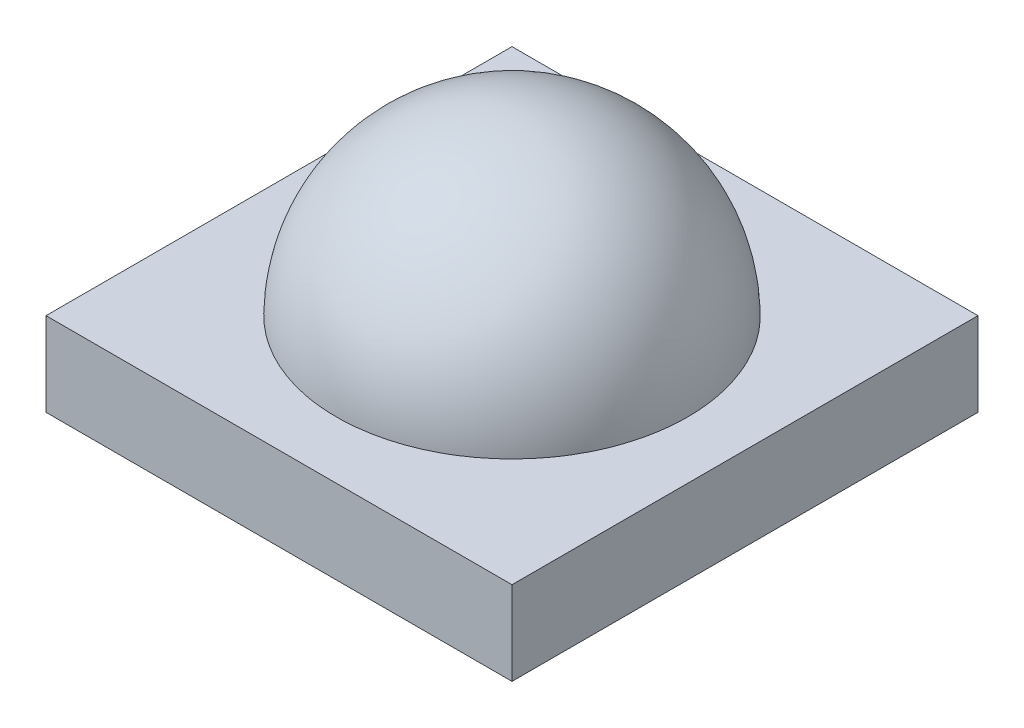
ISO-10303-21;
HEADER;
FILE_DESCRIPTION(('STEP AP214'),'2;1');
FILE_NAME('part.step','',(''),(''),'','','');
FILE_SCHEMA(('AUTOMOTIVE_DESIGN { 1 0 10303 214 1 1 1 1 }'));
ENDSEC;
DATA;
#1=APPLICATION_CONTEXT('core data for automotive mechanical design processes');
#2=APPLICATION_PROTOCOL_DEFINITION('international standard','automotive_design',2000,#1);
#3=PRODUCT_CONTEXT('',#1,'mechanical');
#4=PRODUCT('Part','Part','',(#3));
#5=PRODUCT_RELATED_PRODUCT_CATEGORY('part','',(#4));
#6=PRODUCT_DEFINITION_FORMATION('','',#4);
#7=PRODUCT_DEFINITION_CONTEXT('part definition',#1,'design');
#8=PRODUCT_DEFINITION('design','',#6,#7);
#9=PRODUCT_DEFINITION_SHAPE('','',#8);
#10=(LENGTH_UNIT() NAMED_UNIT(*) SI_UNIT(.MILLI.,.METRE.));
#11=(NAMED_UNIT(*) PLANE_ANGLE_UNIT() SI_UNIT($,.RADIAN.));
#12=(NAMED_UNIT(*) SI_UNIT($,.STERADIAN.) SOLID_ANGLE_UNIT());
#13=UNCERTAINTY_MEASURE_WITH_UNIT(LENGTH_MEASURE(1.E-05),#10,'distance_accuracy_value','');
#14=(GEOMETRIC_REPRESENTATION_CONTEXT(3) GLOBAL_UNCERTAINTY_ASSIGNED_CONTEXT((#13)) GLOBAL_UNIT_ASSIGNED_CONTEXT((#10,
#11,#12)) REPRESENTATION_CONTEXT('',''));
#15=CARTESIAN_POINT('',(0.,0.,0.));
#16=DIRECTION('',(0.,0.,1.));
#17=DIRECTION('',(1.,0.,0.));
#18=AXIS2_PLACEMENT_3D('',#15,#16,#17);
#19=CARTESIAN_POINT('',(-2.54,0.6,0.));
#20=DIRECTION('',(1.,0.,0.));
#21=DIRECTION('',(0.,1.,0.));
#22=AXIS2_PLACEMENT_3D('',#19,#20,#21);
#23=SPHERICAL_SURFACE('',#22,1.3);
#24=CARTESIAN_POINT('',(-3.83984614474175,0.62,0.));
#25=CARTESIAN_POINT('',(-3.83984655557343,0.62,0.0133376037862006));
#26=CARTESIAN_POINT('',(-3.83964114284594,0.62,0.0266716627647828));
#27=CARTESIAN_POINT('',(-3.83758495609044,0.62,0.0934165811325725));
#28=CARTESIAN_POINT('',(-3.83264387007009,0.62,0.146765048220109));
#29=CARTESIAN_POINT('',(-3.81320765311562,0.62,0.271783256173086));
#30=CARTESIAN_POINT('',(-3.79588384153375,0.62,0.34303384707391));
#31=CARTESIAN_POINT('',(-3.76114273193864,0.62,0.446937577743441));
#32=CARTESIAN_POINT('',(-3.74808459547026,0.62,0.481111499095582));
#33=CARTESIAN_POINT('',(-3.71912488551279,0.62,0.548272245651136));
#34=CARTESIAN_POINT('',(-3.70322068620494,0.62,0.581257940529096));
#35=CARTESIAN_POINT('',(-3.65146348916196,0.62,0.677921630357325));
#36=CARTESIAN_POINT('',(-3.61151388530399,0.62,0.73946121597336));
#37=CARTESIAN_POINT('',(-3.52183790804712,0.62,0.854949776450851));
#38=CARTESIAN_POINT('',(-3.47211146347502,0.62,0.908898696049052));
#39=CARTESIAN_POINT('',(-3.39130438934842,0.62,0.98296580449178));
#40=CARTESIAN_POINT('',(-3.36331181395965,0.62,1.00652548538735));
#41=CARTESIAN_POINT('',(-3.30547170229357,0.62,1.05118366292618));
#42=CARTESIAN_POINT('',(-3.27562597090515,0.62,1.07228449847793));
#43=CARTESIAN_POINT('',(-3.18355181470092,0.62,1.13171015499637));
#44=CARTESIAN_POINT('',(-3.11876802655875,0.62,1.16617495919287));
#45=CARTESIAN_POINT('',(-2.98436896210293,0.62,1.2237184907284));
#46=CARTESIAN_POINT('',(-2.91475383849276,0.62,1.24679757774772));
#47=CARTESIAN_POINT('',(-2.77262878139365,0.62,1.28094575438073));
#48=CARTESIAN_POINT('',(-2.70011887422256,0.62,1.29201495315628));
#49=CARTESIAN_POINT('',(-2.55427189667387,0.62,1.30182156039609));
#50=CARTESIAN_POINT('',(-2.48093482229732,0.62,1.30055890921629));
#51=CARTESIAN_POINT('',(-2.3355129720429,0.62,1.28573964951476));
#52=CARTESIAN_POINT('',(-2.2634281954341,0.62,1.2721830481688));
#53=CARTESIAN_POINT('',(-2.12255798444406,0.62,1.23316020525569));
#54=CARTESIAN_POINT('',(-2.05377254656807,0.62,1.2076939763038));
#55=CARTESIAN_POINT('',(-1.92145315724329,0.62,1.14557476195844));
#56=CARTESIAN_POINT('',(-1.85791921998544,0.62,1.10892174633655));
#57=CARTESIAN_POINT('',(-1.73790633574147,0.62,1.02546955306683));
#58=CARTESIAN_POINT('',(-1.68142742793487,0.62,0.97867031907678));
#59=CARTESIAN_POINT('',(-1.57712889894981,0.62,0.876253653943748));
#60=CARTESIAN_POINT('',(-1.52930915821094,0.62,0.820636344575167));
#61=CARTESIAN_POINT('',(-1.44368709572069,0.62,0.702168703344013));
#62=CARTESIAN_POINT('',(-1.40588449114724,0.62,0.639318575763432));
#63=CARTESIAN_POINT('',(-1.34136405320703,0.62,0.508144123247066));
#64=CARTESIAN_POINT('',(-1.31464699911199,0.619999999999999,0.439819413871818));
#65=CARTESIAN_POINT('',(-1.27605606309184,0.62,0.309786277359226));
#66=CARTESIAN_POINT('',(-1.26260007476469,0.62,0.248539505287499));
#67=CARTESIAN_POINT('',(-1.2446597002265,0.62,0.124834016630756));
#68=CARTESIAN_POINT('',(-1.24015577666462,0.619999999999998,0.0623782403249561));
#69=CARTESIAN_POINT('',(-1.24015344442657,0.619999999999999,-0.0133376037862086));
#70=CARTESIAN_POINT('',(-1.24035885715406,0.62,-0.0266716627647871));
#71=CARTESIAN_POINT('',(-1.24241504390956,0.620000000000001,-0.0934165811325739));
#72=CARTESIAN_POINT('',(-1.24735612992991,0.62,-0.146765048220111));
#73=CARTESIAN_POINT('',(-1.26679234688438,0.62,-0.271783256173089));
#74=CARTESIAN_POINT('',(-1.28411615846625,0.62,-0.343033847073913));
#75=CARTESIAN_POINT('',(-1.31885726806137,0.62,-0.446937577743445));
#76=CARTESIAN_POINT('',(-1.33191540452975,0.62,-0.481111499095585));
#77=CARTESIAN_POINT('',(-1.36087511448721,0.62,-0.548272245651139));
#78=CARTESIAN_POINT('',(-1.37677931379506,0.62,-0.581257940529099));
#79=CARTESIAN_POINT('',(-1.42853651083804,0.62,-0.677921630357328));
#80=CARTESIAN_POINT('',(-1.46848611469602,0.62,-0.739461215973363));
#81=CARTESIAN_POINT('',(-1.55816209195288,0.62,-0.854949776450854));
#82=CARTESIAN_POINT('',(-1.60788853652498,0.62,-0.908898696049054));
#83=CARTESIAN_POINT('',(-1.68869561065158,0.62,-0.982965804491782));
#84=CARTESIAN_POINT('',(-1.71668818604035,0.62,-1.00652548538735));
#85=CARTESIAN_POINT('',(-1.77452829770643,0.62,-1.05118366292618));
#86=CARTESIAN_POINT('',(-1.80437402909486,0.62,-1.07228449847794));
#87=CARTESIAN_POINT('',(-1.89644818529908,0.62,-1.13171015499637));
#88=CARTESIAN_POINT('',(-1.96123197344125,0.62,-1.16617495919287));
#89=CARTESIAN_POINT('',(-2.09563103789707,0.62,-1.2237184907284));
#90=CARTESIAN_POINT('',(-2.16524616150724,0.62,-1.24679757774772));
#91=CARTESIAN_POINT('',(-2.30737121860636,0.62,-1.28094575438073));
#92=CARTESIAN_POINT('',(-2.37988112577744,0.62,-1.29201495315628));
#93=CARTESIAN_POINT('',(-2.52572810332613,0.62,-1.30182156039609));
#94=CARTESIAN_POINT('',(-2.59906517770268,0.62,-1.30055890921629));
#95=CARTESIAN_POINT('',(-2.74448702795711,0.62,-1.28573964951476));
#96=CARTESIAN_POINT('',(-2.8165718045659,0.62,-1.2721830481688));
#97=CARTESIAN_POINT('',(-2.95744201555595,0.62,-1.23316020525569));
#98=CARTESIAN_POINT('',(-3.02622745343193,0.62,-1.20769397630379));
#99=CARTESIAN_POINT('',(-3.15854684275672,0.62,-1.14557476195844));
#100=CARTESIAN_POINT('',(-3.22208078001457,0.620000000000001,-1.10892174633655));
#101=CARTESIAN_POINT('',(-3.34209366425853,0.620000000000001,-1.02546955306683));
#102=CARTESIAN_POINT('',(-3.39857257206513,0.62,-0.978670319076778));
#103=CARTESIAN_POINT('',(-3.5028711010502,0.62,-0.876253653943745));
#104=CARTESIAN_POINT('',(-3.55069084178906,0.62,-0.820636344575165));
#105=CARTESIAN_POINT('',(-3.63631290427932,0.62,-0.70216870334401));
#106=CARTESIAN_POINT('',(-3.67411550885276,0.62,-0.639318575763428));
#107=CARTESIAN_POINT('',(-3.73863594679298,0.62,-0.508144123247063));
#108=CARTESIAN_POINT('',(-3.76535300088801,0.619999999999999,-0.439819413871814));
#109=CARTESIAN_POINT('',(-3.80394393690816,0.62,-0.309786277359225));
#110=CARTESIAN_POINT('',(-3.8173999252353,0.62,-0.2485395052875));
#111=CARTESIAN_POINT('',(-3.83534029977349,0.62,-0.124834016630762));
#112=CARTESIAN_POINT('',(-3.83984422333537,0.62,-0.062378240324965));
#113=CARTESIAN_POINT('',(-3.83984614474175,0.62,0.));
#114=B_SPLINE_CURVE_WITH_KNOTS('',3,(#24,#25,#26,#27,#28,#29,#30,#31,#32,#33,#34,#35,#36,#37,
#38,#39,#40,#41,#42,#43,#44,#45,#46,#47,#48,#49,#50,#51,#52,#53,#54,#55,#56,#57,#58,#59,#60,#61,
#62,#63,#64,#65,#66,#67,#68,#69,#70,#71,#72,#73,#74,#75,#76,#77,#78,#79,#80,#81,#82,#83,#84,#85,
#86,#87,#88,#89,#90,#91,#92,#93,#94,#95,#96,#97,#98,#99,#100,#101,#102,#103,#104,#105,#106,#107,
#108,#109,#110,#111,#112,#113),.UNSPECIFIED.,.T.,.F.,(4,2,2,2,2,2,2,2,2,2,2,2,2,2,2,2,2,2,2,2,2,
2,2,2,2,2,2,2,2,2,2,2,2,2,2,2,2,2,2,2,2,2,2,2,4),(0.,0.0400063154493854,0.200317721174631,
0.419135523863878,0.528777526511949,0.638521212950158,0.857524471274162,1.07652932395191,
1.18617740857296,1.2957203270571,1.51473229700781,1.7337373478216,1.95274040800921,
2.17174452742446,2.39074851901066,2.60975227861776,2.8287566300121,3.04776219757458,
3.26676474101347,3.48576110051416,3.70477285201297,3.89228688205201,4.07939122250334,
4.11939753795271,4.27970894367796,4.49852674636721,4.60816874901528,4.71791243545349,
4.93691569377749,5.15592054645524,5.26556863107629,5.37511154956043,5.59412351951114,
5.81312857032493,6.03213163051254,6.25113574992779,6.47013974151399,6.6891435011211,
6.90814785251543,7.12715342007791,7.3461559635168,7.56515232301749,7.78416407451631,
7.97167810455533,8.15878244500665),.UNSPECIFIED.);
#115=CARTESIAN_POINT('',(-3.83984614474175,0.62,0.));
#116=VERTEX_POINT('',#115);
#117=EDGE_CURVE('E20',#116,#116,#114,.T.);
#118=ORIENTED_EDGE('',*,*,#117,.T.);
#119=EDGE_LOOP('',(#118));
#120=FACE_BOUND('',#119,.T.);
#121=ADVANCED_FACE('F15',(#120),#23,.T.);
#122=CARTESIAN_POINT('',(0.,0.62,0.));
#123=DIRECTION('',(0.,-1.,0.));
#124=DIRECTION('',(0.,0.,-1.));
#125=AXIS2_PLACEMENT_3D('',#122,#123,#124);
#126=PLANE('',#125);
#127=DIRECTION('',(-1.,0.,0.));
#128=VECTOR('',#127,1.);
#129=CARTESIAN_POINT('',(-0.815,0.62,1.72499999999999));
#130=LINE('',#129,#128);
#131=CARTESIAN_POINT('',(-4.265,0.62,1.72499999999999));
#132=VERTEX_POINT('',#131);
#133=CARTESIAN_POINT('',(-0.815000000000001,0.62,1.72499999999999));
#134=VERTEX_POINT('',#133);
#135=EDGE_CURVE('E87',#132,#134,#130,.F.);
#136=ORIENTED_EDGE('',*,*,#135,.T.);
#137=DIRECTION('',(0.,0.,1.));
#138=VECTOR('',#137,1.);
#139=CARTESIAN_POINT('',(-0.815000000000002,0.62,-1.72500000000001));
#140=LINE('',#139,#138);
#141=CARTESIAN_POINT('',(-0.815000000000002,0.62,-1.72500000000001));
#142=VERTEX_POINT('',#141);
#143=EDGE_CURVE('E56',#134,#142,#140,.F.);
#144=ORIENTED_EDGE('',*,*,#143,.T.);
#145=DIRECTION('',(1.,0.,0.));
#146=VECTOR('',#145,1.);
#147=CARTESIAN_POINT('',(-0.815000000000002,0.62,-1.72500000000001));
#148=LINE('',#147,#146);
#149=CARTESIAN_POINT('',(-4.265,0.62,-1.72500000000001));
#150=VERTEX_POINT('',#149);
#151=EDGE_CURVE('E58',#142,#150,#148,.F.);
#152=ORIENTED_EDGE('',*,*,#151,.T.);
#153=DIRECTION('',(0.,0.,-1.));
#154=VECTOR('',#153,1.);
#155=CARTESIAN_POINT('',(-4.265,0.62,-1.72500000000001));
#156=LINE('',#155,#154);
#157=EDGE_CURVE('E62',#150,#132,#156,.F.);
#158=ORIENTED_EDGE('',*,*,#157,.T.);
#159=EDGE_LOOP('',(#136,#144,#152,#158));
#160=FACE_BOUND('',#159,.T.);
#161=ORIENTED_EDGE('',*,*,#117,.F.);
#162=EDGE_LOOP('',(#161));
#163=FACE_BOUND('',#162,.T.);
#164=ADVANCED_FACE('F60',(#160,#163),#126,.F.);
#165=CARTESIAN_POINT('',(-4.265,0.62,-1.72500000000001));
#166=DIRECTION('',(1.,0.,0.));
#167=DIRECTION('',(0.,0.,-1.));
#168=AXIS2_PLACEMENT_3D('',#165,#166,#167);
#169=PLANE('',#168);
#170=DIRECTION('',(0.,1.,0.));
#171=VECTOR('',#170,1.);
#172=CARTESIAN_POINT('',(-4.265,0.62,1.72499999999999));
#173=LINE('',#172,#171);
#174=CARTESIAN_POINT('',(-4.265,0.,1.72499999999999));
#175=VERTEX_POINT('',#174);
#176=EDGE_CURVE('E73',#175,#132,#173,.T.);
#177=ORIENTED_EDGE('',*,*,#176,.T.);
#178=ORIENTED_EDGE('',*,*,#157,.F.);
#179=DIRECTION('',(0.,1.,0.));
#180=VECTOR('',#179,1.);
#181=CARTESIAN_POINT('',(-4.265,0.62,-1.72500000000001));
#182=LINE('',#181,#180);
#183=CARTESIAN_POINT('',(-4.265,0.,-1.72500000000001));
#184=VERTEX_POINT('',#183);
#185=EDGE_CURVE('E67',#150,#184,#182,.F.);
#186=ORIENTED_EDGE('',*,*,#185,.T.);
#187=DIRECTION('',(0.,0.,-1.));
#188=VECTOR('',#187,1.);
#189=CARTESIAN_POINT('',(-4.265,0.,0.));
#190=LINE('',#189,#188);
#191=EDGE_CURVE('E90',#175,#184,#190,.T.);
#192=ORIENTED_EDGE('',*,*,#191,.F.);
#193=EDGE_LOOP('',(#177,#178,#186,#192));
#194=FACE_BOUND('',#193,.T.);
#195=ADVANCED_FACE('F70',(#194),#169,.F.);
#196=CARTESIAN_POINT('',(-0.815000000000002,0.62,-1.72500000000001));
#197=DIRECTION('',(0.,0.,1.));
#198=DIRECTION('',(1.,0.,0.));
#199=AXIS2_PLACEMENT_3D('',#196,#197,#198);
#200=PLANE('',#199);
#201=ORIENTED_EDGE('',*,*,#185,.F.);
#202=ORIENTED_EDGE('',*,*,#151,.F.);
#203=DIRECTION('',(0.,1.,0.));
#204=VECTOR('',#203,1.);
#205=CARTESIAN_POINT('',(-0.815000000000002,0.62,-1.72500000000001));
#206=LINE('',#205,#204);
#207=CARTESIAN_POINT('',(-0.815000000000002,0.,-1.72500000000001));
#208=VERTEX_POINT('',#207);
#209=EDGE_CURVE('E81',#142,#208,#206,.F.);
#210=ORIENTED_EDGE('',*,*,#209,.T.);
#211=DIRECTION('',(1.,0.,0.));
#212=VECTOR('',#211,1.);
#213=CARTESIAN_POINT('',(0.,0.,-1.72500000000001));
#214=LINE('',#213,#212);
#215=EDGE_CURVE('E78',#184,#208,#214,.T.);
#216=ORIENTED_EDGE('',*,*,#215,.F.);
#217=EDGE_LOOP('',(#201,#202,#210,#216));
#218=FACE_BOUND('',#217,.T.);
#219=ADVANCED_FACE('F76',(#218),#200,.F.);
#220=CARTESIAN_POINT('',(-0.815000000000002,0.62,-1.72500000000001));
#221=DIRECTION('',(-1.,0.,0.));
#222=DIRECTION('',(0.,0.,1.));
#223=AXIS2_PLACEMENT_3D('',#220,#221,#222);
#224=PLANE('',#223);
#225=ORIENTED_EDGE('',*,*,#209,.F.);
#226=ORIENTED_EDGE('',*,*,#143,.F.);
#227=DIRECTION('',(0.,1.,0.));
#228=VECTOR('',#227,1.);
#229=CARTESIAN_POINT('',(-0.815,0.62,1.72499999999999));
#230=LINE('',#229,#228);
#231=CARTESIAN_POINT('',(-0.815000000000001,0.,1.72499999999999));
#232=VERTEX_POINT('',#231);
#233=EDGE_CURVE('E36',#134,#232,#230,.F.);
#234=ORIENTED_EDGE('',*,*,#233,.T.);
#235=DIRECTION('',(0.,0.,-1.));
#236=VECTOR('',#235,1.);
#237=CARTESIAN_POINT('',(-0.815000000000002,0.,0.));
#238=LINE('',#237,#236);
#239=EDGE_CURVE('E27',#208,#232,#238,.F.);
#240=ORIENTED_EDGE('',*,*,#239,.F.);
#241=EDGE_LOOP('',(#225,#226,#234,#240));
#242=FACE_BOUND('',#241,.T.);
#243=ADVANCED_FACE('F96',(#242),#224,.F.);
#244=CARTESIAN_POINT('',(-0.815,0.62,1.72499999999999));
#245=DIRECTION('',(0.,0.,-1.));
#246=DIRECTION('',(-1.,0.,0.));
#247=AXIS2_PLACEMENT_3D('',#244,#245,#246);
#248=PLANE('',#247);
#249=ORIENTED_EDGE('',*,*,#233,.F.);
#250=ORIENTED_EDGE('',*,*,#135,.F.);
#251=ORIENTED_EDGE('',*,*,#176,.F.);
#252=DIRECTION('',(1.,0.,0.));
#253=VECTOR('',#252,1.);
#254=CARTESIAN_POINT('',(0.,0.,1.72499999999999));
#255=LINE('',#254,#253);
#256=EDGE_CURVE('E10',#232,#175,#255,.F.);
#257=ORIENTED_EDGE('',*,*,#256,.F.);
#258=EDGE_LOOP('',(#249,#250,#251,#257));
#259=FACE_BOUND('',#258,.T.);
#260=ADVANCED_FACE('F98',(#259),#248,.F.);
#261=CARTESIAN_POINT('',(0.,0.,0.));
#262=DIRECTION('',(0.,-1.,0.));
#263=DIRECTION('',(0.,0.,-1.));
#264=AXIS2_PLACEMENT_3D('',#261,#262,#263);
#265=PLANE('',#264);
#266=ORIENTED_EDGE('',*,*,#239,.T.);
#267=ORIENTED_EDGE('',*,*,#256,.T.);
#268=ORIENTED_EDGE('',*,*,#191,.T.);
#269=ORIENTED_EDGE('',*,*,#215,.T.);
#270=EDGE_LOOP('',(#266,#267,#268,#269));
#271=FACE_BOUND('',#270,.T.);
#272=ADVANCED_FACE('F95',(#271),#265,.T.);
#273=CLOSED_SHELL('',(#121,#164,#195,#219,#243,#260,#272));
#274=MANIFOLD_SOLID_BREP('B1',#273);
#275=ADVANCED_BREP_SHAPE_REPRESENTATION('',(#18,#274),#14);
#276=SHAPE_DEFINITION_REPRESENTATION(#9,#275);
ENDSEC;
END-ISO-10303-21;
